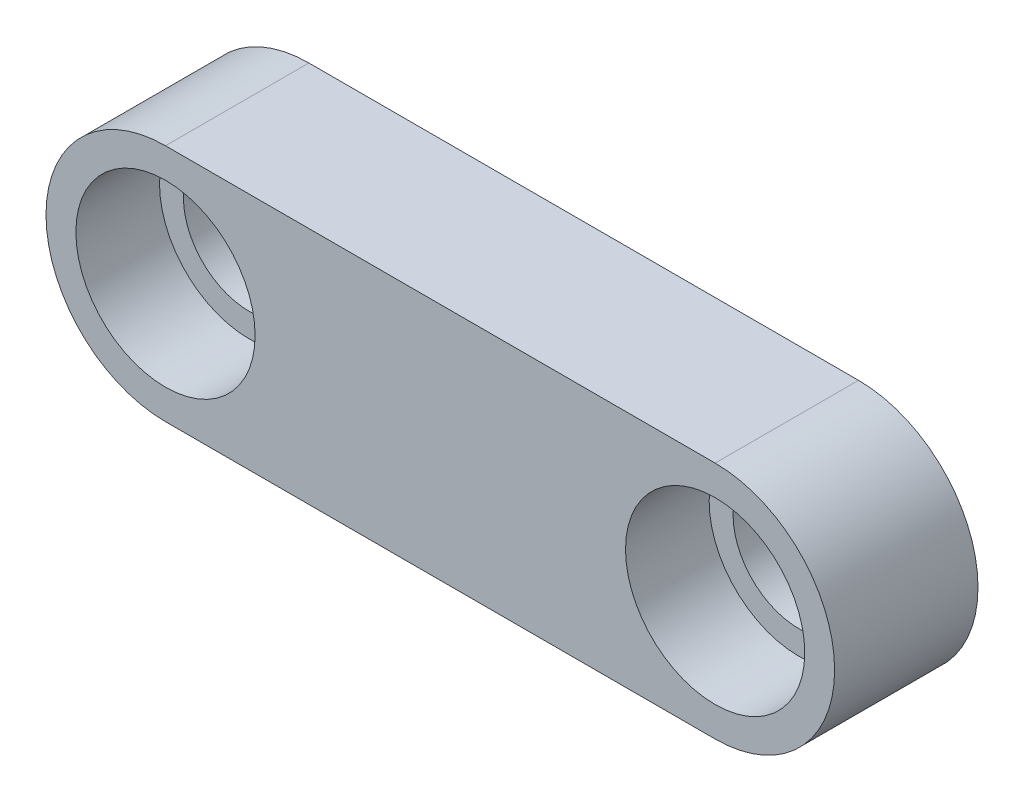
ISO-10303-21;
HEADER;
FILE_DESCRIPTION(('STEP AP214'),'2;1');
FILE_NAME('part.step','',(''),(''),'','','');
FILE_SCHEMA(('AUTOMOTIVE_DESIGN { 1 0 10303 214 1 1 1 1 }'));
ENDSEC;
DATA;
#1=APPLICATION_CONTEXT('core data for automotive mechanical design processes');
#2=APPLICATION_PROTOCOL_DEFINITION('international standard','automotive_design',2000,#1);
#3=PRODUCT_CONTEXT('',#1,'mechanical');
#4=PRODUCT('Part','Part','',(#3));
#5=PRODUCT_RELATED_PRODUCT_CATEGORY('part','',(#4));
#6=PRODUCT_DEFINITION_FORMATION('','',#4);
#7=PRODUCT_DEFINITION_CONTEXT('part definition',#1,'design');
#8=PRODUCT_DEFINITION('design','',#6,#7);
#9=PRODUCT_DEFINITION_SHAPE('','',#8);
#10=(LENGTH_UNIT() NAMED_UNIT(*) SI_UNIT(.MILLI.,.METRE.));
#11=(NAMED_UNIT(*) PLANE_ANGLE_UNIT() SI_UNIT($,.RADIAN.));
#12=(NAMED_UNIT(*) SI_UNIT($,.STERADIAN.) SOLID_ANGLE_UNIT());
#13=UNCERTAINTY_MEASURE_WITH_UNIT(LENGTH_MEASURE(1.E-05),#10,'distance_accuracy_value','');
#14=(GEOMETRIC_REPRESENTATION_CONTEXT(3) GLOBAL_UNCERTAINTY_ASSIGNED_CONTEXT((#13)) GLOBAL_UNIT_ASSIGNED_CONTEXT((#10,
#11,#12)) REPRESENTATION_CONTEXT('',''));
#15=CARTESIAN_POINT('',(0.,0.,0.));
#16=DIRECTION('',(0.,0.,1.));
#17=DIRECTION('',(1.,0.,0.));
#18=AXIS2_PLACEMENT_3D('',#15,#16,#17);
#19=CARTESIAN_POINT('',(0.,0.,6.));
#20=DIRECTION('',(0.,0.,-1.));
#21=DIRECTION('',(-1.,0.,0.));
#22=AXIS2_PLACEMENT_3D('',#19,#20,#21);
#23=CYLINDRICAL_SURFACE('',#22,5.);
#24=CARTESIAN_POINT('',(0.,0.,0.));
#25=DIRECTION('',(0.,0.,1.));
#26=DIRECTION('',(1.,0.,0.));
#27=AXIS2_PLACEMENT_3D('',#24,#25,#26);
#28=CIRCLE('',#27,5.);
#29=CARTESIAN_POINT('',(0.,5.,0.));
#30=VERTEX_POINT('',#29);
#31=CARTESIAN_POINT('',(0.,-5.,0.));
#32=VERTEX_POINT('',#31);
#33=EDGE_CURVE('E98',#30,#32,#28,.T.);
#34=ORIENTED_EDGE('',*,*,#33,.T.);
#35=DIRECTION('',(0.,0.,-1.));
#36=VECTOR('',#35,1.);
#37=CARTESIAN_POINT('',(0.,-5.,6.));
#38=LINE('',#37,#36);
#39=CARTESIAN_POINT('',(0.,-5.,6.));
#40=VERTEX_POINT('',#39);
#41=EDGE_CURVE('E11',#40,#32,#38,.T.);
#42=ORIENTED_EDGE('',*,*,#41,.F.);
#43=CARTESIAN_POINT('',(0.,0.,6.));
#44=DIRECTION('',(0.,0.,1.));
#45=DIRECTION('',(1.,0.,0.));
#46=AXIS2_PLACEMENT_3D('',#43,#44,#45);
#47=CIRCLE('',#46,5.);
#48=CARTESIAN_POINT('',(0.,5.,6.));
#49=VERTEX_POINT('',#48);
#50=EDGE_CURVE('E86',#49,#40,#47,.T.);
#51=ORIENTED_EDGE('',*,*,#50,.F.);
#52=DIRECTION('',(0.,0.,-1.));
#53=VECTOR('',#52,1.);
#54=CARTESIAN_POINT('',(0.,5.,6.));
#55=LINE('',#54,#53);
#56=EDGE_CURVE('E94',#49,#30,#55,.T.);
#57=ORIENTED_EDGE('',*,*,#56,.T.);
#58=EDGE_LOOP('',(#34,#42,#51,#57));
#59=FACE_BOUND('',#58,.T.);
#60=ADVANCED_FACE('F35',(#59),#23,.T.);
#61=CARTESIAN_POINT('',(0.,-5.,6.));
#62=DIRECTION('',(0.,1.,0.));
#63=DIRECTION('',(0.,0.,1.));
#64=AXIS2_PLACEMENT_3D('',#61,#62,#63);
#65=PLANE('',#64);
#66=DIRECTION('',(1.,0.,0.));
#67=VECTOR('',#66,1.);
#68=CARTESIAN_POINT('',(0.,-5.,0.));
#69=LINE('',#68,#67);
#70=CARTESIAN_POINT('',(23.,-5.,0.));
#71=VERTEX_POINT('',#70);
#72=EDGE_CURVE('E90',#32,#71,#69,.T.);
#73=ORIENTED_EDGE('',*,*,#72,.T.);
#74=DIRECTION('',(0.,0.,-1.));
#75=VECTOR('',#74,1.);
#76=CARTESIAN_POINT('',(23.,-5.,6.));
#77=LINE('',#76,#75);
#78=CARTESIAN_POINT('',(23.,-5.,6.));
#79=VERTEX_POINT('',#78);
#80=EDGE_CURVE('E43',#79,#71,#77,.T.);
#81=ORIENTED_EDGE('',*,*,#80,.F.);
#82=DIRECTION('',(1.,0.,0.));
#83=VECTOR('',#82,1.);
#84=CARTESIAN_POINT('',(0.,-5.,6.));
#85=LINE('',#84,#83);
#86=EDGE_CURVE('E81',#40,#79,#85,.T.);
#87=ORIENTED_EDGE('',*,*,#86,.F.);
#88=ORIENTED_EDGE('',*,*,#41,.T.);
#89=EDGE_LOOP('',(#73,#81,#87,#88));
#90=FACE_BOUND('',#89,.T.);
#91=ADVANCED_FACE('F89',(#90),#65,.F.);
#92=CARTESIAN_POINT('',(23.,0.,6.));
#93=DIRECTION('',(0.,0.,-1.));
#94=DIRECTION('',(-1.,0.,0.));
#95=AXIS2_PLACEMENT_3D('',#92,#93,#94);
#96=CYLINDRICAL_SURFACE('',#95,5.);
#97=CARTESIAN_POINT('',(23.,0.,0.));
#98=DIRECTION('',(0.,0.,1.));
#99=DIRECTION('',(1.,0.,0.));
#100=AXIS2_PLACEMENT_3D('',#97,#98,#99);
#101=CIRCLE('',#100,5.);
#102=CARTESIAN_POINT('',(23.,5.,0.));
#103=VERTEX_POINT('',#102);
#104=EDGE_CURVE('E68',#71,#103,#101,.T.);
#105=ORIENTED_EDGE('',*,*,#104,.T.);
#106=DIRECTION('',(0.,0.,-1.));
#107=VECTOR('',#106,1.);
#108=CARTESIAN_POINT('',(23.,5.,6.));
#109=LINE('',#108,#107);
#110=CARTESIAN_POINT('',(23.,5.,6.));
#111=VERTEX_POINT('',#110);
#112=EDGE_CURVE('E91',#111,#103,#109,.T.);
#113=ORIENTED_EDGE('',*,*,#112,.F.);
#114=CARTESIAN_POINT('',(23.,0.,6.));
#115=DIRECTION('',(0.,0.,1.));
#116=DIRECTION('',(1.,0.,0.));
#117=AXIS2_PLACEMENT_3D('',#114,#115,#116);
#118=CIRCLE('',#117,5.);
#119=EDGE_CURVE('E84',#79,#111,#118,.T.);
#120=ORIENTED_EDGE('',*,*,#119,.F.);
#121=ORIENTED_EDGE('',*,*,#80,.T.);
#122=EDGE_LOOP('',(#105,#113,#120,#121));
#123=FACE_BOUND('',#122,.T.);
#124=ADVANCED_FACE('F92',(#123),#96,.T.);
#125=CARTESIAN_POINT('',(0.,5.,6.));
#126=DIRECTION('',(0.,-1.,0.));
#127=DIRECTION('',(0.,0.,-1.));
#128=AXIS2_PLACEMENT_3D('',#125,#126,#127);
#129=PLANE('',#128);
#130=DIRECTION('',(-1.,0.,0.));
#131=VECTOR('',#130,1.);
#132=CARTESIAN_POINT('',(0.,5.,0.));
#133=LINE('',#132,#131);
#134=EDGE_CURVE('E74',#103,#30,#133,.T.);
#135=ORIENTED_EDGE('',*,*,#134,.T.);
#136=ORIENTED_EDGE('',*,*,#56,.F.);
#137=DIRECTION('',(-1.,0.,0.));
#138=VECTOR('',#137,1.);
#139=CARTESIAN_POINT('',(0.,5.,6.));
#140=LINE('',#139,#138);
#141=EDGE_CURVE('E51',#111,#49,#140,.T.);
#142=ORIENTED_EDGE('',*,*,#141,.F.);
#143=ORIENTED_EDGE('',*,*,#112,.T.);
#144=EDGE_LOOP('',(#135,#136,#142,#143));
#145=FACE_BOUND('',#144,.T.);
#146=ADVANCED_FACE('F106',(#145),#129,.F.);
#147=CARTESIAN_POINT('',(0.,0.,6.));
#148=DIRECTION('',(0.,0.,1.));
#149=DIRECTION('',(1.,0.,0.));
#150=AXIS2_PLACEMENT_3D('',#147,#148,#149);
#151=PLANE('',#150);
#152=CARTESIAN_POINT('',(23.,0.,6.));
#153=DIRECTION('',(0.,0.,-1.));
#154=DIRECTION('',(-1.,0.,0.));
#155=AXIS2_PLACEMENT_3D('',#152,#153,#154);
#156=CIRCLE('',#155,3.75);
#157=CARTESIAN_POINT('',(19.25,0.,6.));
#158=VERTEX_POINT('',#157);
#159=EDGE_CURVE('E123',#158,#158,#156,.T.);
#160=ORIENTED_EDGE('',*,*,#159,.T.);
#161=EDGE_LOOP('',(#160));
#162=FACE_BOUND('',#161,.T.);
#163=CARTESIAN_POINT('',(0.,0.,6.));
#164=DIRECTION('',(0.,0.,-1.));
#165=DIRECTION('',(-1.,0.,0.));
#166=AXIS2_PLACEMENT_3D('',#163,#164,#165);
#167=CIRCLE('',#166,3.75);
#168=CARTESIAN_POINT('',(-3.75,0.,6.));
#169=VERTEX_POINT('',#168);
#170=EDGE_CURVE('E101',#169,#169,#167,.T.);
#171=ORIENTED_EDGE('',*,*,#170,.T.);
#172=EDGE_LOOP('',(#171));
#173=FACE_BOUND('',#172,.T.);
#174=ORIENTED_EDGE('',*,*,#50,.T.);
#175=ORIENTED_EDGE('',*,*,#86,.T.);
#176=ORIENTED_EDGE('',*,*,#119,.T.);
#177=ORIENTED_EDGE('',*,*,#141,.T.);
#178=EDGE_LOOP('',(#174,#175,#176,#177));
#179=FACE_BOUND('',#178,.T.);
#180=ADVANCED_FACE('F82',(#162,#173,#179),#151,.T.);
#181=CARTESIAN_POINT('',(0.,0.,0.));
#182=DIRECTION('',(0.,0.,1.));
#183=DIRECTION('',(1.,0.,0.));
#184=AXIS2_PLACEMENT_3D('',#181,#182,#183);
#185=PLANE('',#184);
#186=CARTESIAN_POINT('',(23.,0.,0.));
#187=DIRECTION('',(0.,0.,-1.));
#188=DIRECTION('',(-1.,0.,0.));
#189=AXIS2_PLACEMENT_3D('',#186,#187,#188);
#190=CIRCLE('',#189,2.75);
#191=CARTESIAN_POINT('',(20.25,0.,0.));
#192=VERTEX_POINT('',#191);
#193=EDGE_CURVE('E132',#192,#192,#190,.T.);
#194=ORIENTED_EDGE('',*,*,#193,.F.);
#195=EDGE_LOOP('',(#194));
#196=FACE_BOUND('',#195,.T.);
#197=CARTESIAN_POINT('',(0.,0.,0.));
#198=DIRECTION('',(0.,0.,-1.));
#199=DIRECTION('',(-1.,0.,0.));
#200=AXIS2_PLACEMENT_3D('',#197,#198,#199);
#201=CIRCLE('',#200,2.75);
#202=CARTESIAN_POINT('',(-2.75,0.,0.));
#203=VERTEX_POINT('',#202);
#204=EDGE_CURVE('E120',#203,#203,#201,.T.);
#205=ORIENTED_EDGE('',*,*,#204,.F.);
#206=EDGE_LOOP('',(#205));
#207=FACE_BOUND('',#206,.T.);
#208=ORIENTED_EDGE('',*,*,#33,.F.);
#209=ORIENTED_EDGE('',*,*,#134,.F.);
#210=ORIENTED_EDGE('',*,*,#104,.F.);
#211=ORIENTED_EDGE('',*,*,#72,.F.);
#212=EDGE_LOOP('',(#208,#209,#210,#211));
#213=FACE_BOUND('',#212,.T.);
#214=ADVANCED_FACE('F109',(#196,#207,#213),#185,.F.);
#215=CARTESIAN_POINT('',(0.,0.,0.));
#216=DIRECTION('',(0.,0.,-1.));
#217=DIRECTION('',(-1.,0.,0.));
#218=AXIS2_PLACEMENT_3D('',#215,#216,#217);
#219=CYLINDRICAL_SURFACE('',#218,3.75);
#220=ORIENTED_EDGE('',*,*,#170,.F.);
#221=EDGE_LOOP('',(#220));
#222=FACE_BOUND('',#221,.T.);
#223=CARTESIAN_POINT('',(0.,0.,2.5));
#224=DIRECTION('',(0.,0.,-1.));
#225=DIRECTION('',(-1.,0.,0.));
#226=AXIS2_PLACEMENT_3D('',#223,#224,#225);
#227=CIRCLE('',#226,3.75);
#228=CARTESIAN_POINT('',(-3.75,0.,2.5));
#229=VERTEX_POINT('',#228);
#230=EDGE_CURVE('E114',#229,#229,#227,.T.);
#231=ORIENTED_EDGE('',*,*,#230,.T.);
#232=EDGE_LOOP('',(#231));
#233=FACE_BOUND('',#232,.T.);
#234=ADVANCED_FACE('F140',(#222,#233),#219,.F.);
#235=CARTESIAN_POINT('',(-3.75,0.,2.5));
#236=DIRECTION('',(0.,0.,-1.));
#237=DIRECTION('',(-1.,0.,0.));
#238=AXIS2_PLACEMENT_3D('',#235,#236,#237);
#239=PLANE('',#238);
#240=ORIENTED_EDGE('',*,*,#230,.F.);
#241=EDGE_LOOP('',(#240));
#242=FACE_BOUND('',#241,.T.);
#243=CARTESIAN_POINT('',(0.,0.,2.5));
#244=DIRECTION('',(0.,0.,-1.));
#245=DIRECTION('',(-1.,0.,0.));
#246=AXIS2_PLACEMENT_3D('',#243,#244,#245);
#247=CIRCLE('',#246,2.75);
#248=CARTESIAN_POINT('',(-2.75,0.,2.5));
#249=VERTEX_POINT('',#248);
#250=EDGE_CURVE('E117',#249,#249,#247,.T.);
#251=ORIENTED_EDGE('',*,*,#250,.T.);
#252=EDGE_LOOP('',(#251));
#253=FACE_BOUND('',#252,.T.);
#254=ADVANCED_FACE('F147',(#242,#253),#239,.F.);
#255=CARTESIAN_POINT('',(0.,0.,0.));
#256=DIRECTION('',(0.,0.,-1.));
#257=DIRECTION('',(-1.,0.,0.));
#258=AXIS2_PLACEMENT_3D('',#255,#256,#257);
#259=CYLINDRICAL_SURFACE('',#258,2.75);
#260=ORIENTED_EDGE('',*,*,#250,.F.);
#261=EDGE_LOOP('',(#260));
#262=FACE_BOUND('',#261,.T.);
#263=ORIENTED_EDGE('',*,*,#204,.T.);
#264=EDGE_LOOP('',(#263));
#265=FACE_BOUND('',#264,.T.);
#266=ADVANCED_FACE('F144',(#262,#265),#259,.F.);
#267=CARTESIAN_POINT('',(23.,0.,0.));
#268=DIRECTION('',(0.,0.,-1.));
#269=DIRECTION('',(-1.,0.,0.));
#270=AXIS2_PLACEMENT_3D('',#267,#268,#269);
#271=CYLINDRICAL_SURFACE('',#270,3.75);
#272=ORIENTED_EDGE('',*,*,#159,.F.);
#273=EDGE_LOOP('',(#272));
#274=FACE_BOUND('',#273,.T.);
#275=CARTESIAN_POINT('',(23.,0.,2.5));
#276=DIRECTION('',(0.,0.,-1.));
#277=DIRECTION('',(-1.,0.,0.));
#278=AXIS2_PLACEMENT_3D('',#275,#276,#277);
#279=CIRCLE('',#278,3.75);
#280=CARTESIAN_POINT('',(19.25,0.,2.5));
#281=VERTEX_POINT('',#280);
#282=EDGE_CURVE('E126',#281,#281,#279,.T.);
#283=ORIENTED_EDGE('',*,*,#282,.T.);
#284=EDGE_LOOP('',(#283));
#285=FACE_BOUND('',#284,.T.);
#286=ADVANCED_FACE('F146',(#274,#285),#271,.F.);
#287=CARTESIAN_POINT('',(19.25,0.,2.5));
#288=DIRECTION('',(0.,0.,-1.));
#289=DIRECTION('',(-1.,0.,0.));
#290=AXIS2_PLACEMENT_3D('',#287,#288,#289);
#291=PLANE('',#290);
#292=ORIENTED_EDGE('',*,*,#282,.F.);
#293=EDGE_LOOP('',(#292));
#294=FACE_BOUND('',#293,.T.);
#295=CARTESIAN_POINT('',(23.,0.,2.5));
#296=DIRECTION('',(0.,0.,-1.));
#297=DIRECTION('',(-1.,0.,0.));
#298=AXIS2_PLACEMENT_3D('',#295,#296,#297);
#299=CIRCLE('',#298,2.75);
#300=CARTESIAN_POINT('',(20.25,0.,2.5));
#301=VERTEX_POINT('',#300);
#302=EDGE_CURVE('E129',#301,#301,#299,.T.);
#303=ORIENTED_EDGE('',*,*,#302,.T.);
#304=EDGE_LOOP('',(#303));
#305=FACE_BOUND('',#304,.T.);
#306=ADVANCED_FACE('F154',(#294,#305),#291,.F.);
#307=CARTESIAN_POINT('',(23.,0.,0.));
#308=DIRECTION('',(0.,0.,-1.));
#309=DIRECTION('',(-1.,0.,0.));
#310=AXIS2_PLACEMENT_3D('',#307,#308,#309);
#311=CYLINDRICAL_SURFACE('',#310,2.75);
#312=ORIENTED_EDGE('',*,*,#302,.F.);
#313=EDGE_LOOP('',(#312));
#314=FACE_BOUND('',#313,.T.);
#315=ORIENTED_EDGE('',*,*,#193,.T.);
#316=EDGE_LOOP('',(#315));
#317=FACE_BOUND('',#316,.T.);
#318=ADVANCED_FACE('F136',(#314,#317),#311,.F.);
#319=CLOSED_SHELL('',(#60,#91,#124,#146,#180,#214,#234,#254,#266,#286,#306,#318));
#320=MANIFOLD_SOLID_BREP('B2',#319);
#321=ADVANCED_BREP_SHAPE_REPRESENTATION('',(#18,#320),#14);
#322=SHAPE_DEFINITION_REPRESENTATION(#9,#321);
ENDSEC;
END-ISO-10303-21;
